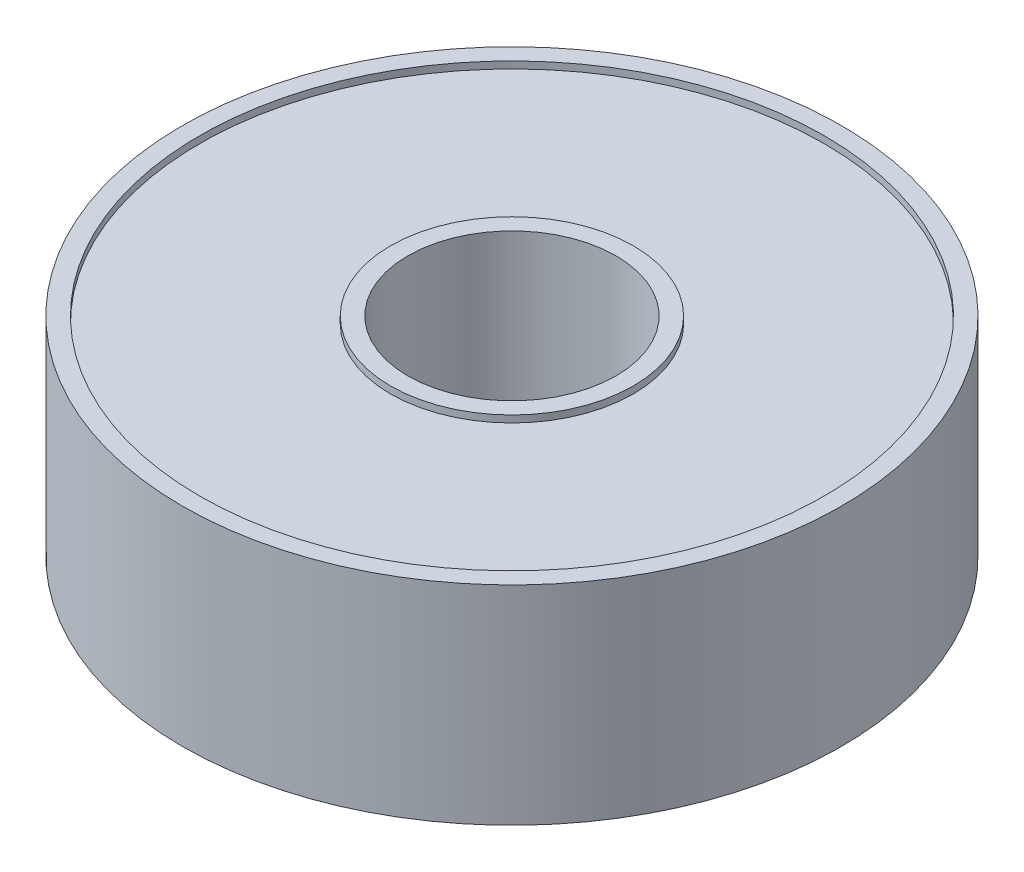
ISO-10303-21;
HEADER;
FILE_DESCRIPTION(('STEP AP214'),'2;1');
FILE_NAME('part.step','',(''),(''),'','','');
FILE_SCHEMA(('AUTOMOTIVE_DESIGN { 1 0 10303 214 1 1 1 1 }'));
ENDSEC;
DATA;
#1=APPLICATION_CONTEXT('core data for automotive mechanical design processes');
#2=APPLICATION_PROTOCOL_DEFINITION('international standard','automotive_design',2000,#1);
#3=PRODUCT_CONTEXT('',#1,'mechanical');
#4=PRODUCT('Part','Part','',(#3));
#5=PRODUCT_RELATED_PRODUCT_CATEGORY('part','',(#4));
#6=PRODUCT_DEFINITION_FORMATION('','',#4);
#7=PRODUCT_DEFINITION_CONTEXT('part definition',#1,'design');
#8=PRODUCT_DEFINITION('design','',#6,#7);
#9=PRODUCT_DEFINITION_SHAPE('','',#8);
#10=(LENGTH_UNIT() NAMED_UNIT(*) SI_UNIT(.MILLI.,.METRE.));
#11=(NAMED_UNIT(*) PLANE_ANGLE_UNIT() SI_UNIT($,.RADIAN.));
#12=(NAMED_UNIT(*) SI_UNIT($,.STERADIAN.) SOLID_ANGLE_UNIT());
#13=UNCERTAINTY_MEASURE_WITH_UNIT(LENGTH_MEASURE(1.E-05),#10,'distance_accuracy_value','');
#14=(GEOMETRIC_REPRESENTATION_CONTEXT(3) GLOBAL_UNCERTAINTY_ASSIGNED_CONTEXT((#13)) GLOBAL_UNIT_ASSIGNED_CONTEXT((#10,
#11,#12)) REPRESENTATION_CONTEXT('',''));
#15=CARTESIAN_POINT('',(0.,0.,0.));
#16=DIRECTION('',(0.,0.,1.));
#17=DIRECTION('',(1.,0.,0.));
#18=AXIS2_PLACEMENT_3D('',#15,#16,#17);
#19=CARTESIAN_POINT('',(0.,-3.,0.));
#20=DIRECTION('',(0.,1.,0.));
#21=DIRECTION('',(0.,0.,1.));
#22=AXIS2_PLACEMENT_3D('',#19,#20,#21);
#23=CYLINDRICAL_SURFACE('',#22,3.5);
#24=CARTESIAN_POINT('',(0.,-3.,0.));
#25=DIRECTION('',(0.,1.,0.));
#26=DIRECTION('',(0.,0.,1.));
#27=AXIS2_PLACEMENT_3D('',#24,#25,#26);
#28=CIRCLE('',#27,3.5);
#29=CARTESIAN_POINT('',(0.,-3.,3.5));
#30=VERTEX_POINT('',#29);
#31=EDGE_CURVE('E54',#30,#30,#28,.T.);
#32=ORIENTED_EDGE('',*,*,#31,.T.);
#33=EDGE_LOOP('',(#32));
#34=FACE_BOUND('',#33,.T.);
#35=CARTESIAN_POINT('',(0.,-2.8,0.));
#36=DIRECTION('',(0.,1.,0.));
#37=DIRECTION('',(0.,0.,1.));
#38=AXIS2_PLACEMENT_3D('',#35,#36,#37);
#39=CIRCLE('',#38,3.5);
#40=CARTESIAN_POINT('',(0.,-2.8,3.5));
#41=VERTEX_POINT('',#40);
#42=EDGE_CURVE('E73',#41,#41,#39,.T.);
#43=ORIENTED_EDGE('',*,*,#42,.F.);
#44=EDGE_LOOP('',(#43));
#45=FACE_BOUND('',#44,.T.);
#46=ADVANCED_FACE('F47',(#34,#45),#23,.T.);
#47=CARTESIAN_POINT('',(0.,-3.,0.));
#48=DIRECTION('',(0.,1.,0.));
#49=DIRECTION('',(0.,0.,1.));
#50=AXIS2_PLACEMENT_3D('',#47,#48,#49);
#51=CYLINDRICAL_SURFACE('',#50,3.);
#52=CARTESIAN_POINT('',(0.,-3.,0.));
#53=DIRECTION('',(0.,1.,0.));
#54=DIRECTION('',(0.,0.,1.));
#55=AXIS2_PLACEMENT_3D('',#52,#53,#54);
#56=CIRCLE('',#55,3.);
#57=CARTESIAN_POINT('',(0.,-3.,3.));
#58=VERTEX_POINT('',#57);
#59=EDGE_CURVE('E58',#58,#58,#56,.T.);
#60=ORIENTED_EDGE('',*,*,#59,.F.);
#61=EDGE_LOOP('',(#60));
#62=FACE_BOUND('',#61,.T.);
#63=CARTESIAN_POINT('',(0.,3.,0.));
#64=DIRECTION('',(0.,1.,0.));
#65=DIRECTION('',(0.,0.,1.));
#66=AXIS2_PLACEMENT_3D('',#63,#64,#65);
#67=CIRCLE('',#66,3.);
#68=CARTESIAN_POINT('',(0.,3.,3.));
#69=VERTEX_POINT('',#68);
#70=EDGE_CURVE('E67',#69,#69,#67,.T.);
#71=ORIENTED_EDGE('',*,*,#70,.T.);
#72=EDGE_LOOP('',(#71));
#73=FACE_BOUND('',#72,.T.);
#74=ADVANCED_FACE('F49',(#62,#73),#51,.F.);
#75=CARTESIAN_POINT('',(0.,2.8,0.));
#76=DIRECTION('',(0.,1.,0.));
#77=DIRECTION('',(0.,0.,1.));
#78=AXIS2_PLACEMENT_3D('',#75,#76,#77);
#79=CIRCLE('',#78,3.5);
#80=CARTESIAN_POINT('',(0.,2.8,3.5));
#81=VERTEX_POINT('',#80);
#82=EDGE_CURVE('E11',#81,#81,#79,.F.);
#83=ORIENTED_EDGE('',*,*,#82,.F.);
#84=EDGE_LOOP('',(#83));
#85=FACE_BOUND('',#84,.T.);
#86=CARTESIAN_POINT('',(0.,3.,0.));
#87=DIRECTION('',(0.,1.,0.));
#88=DIRECTION('',(0.,0.,1.));
#89=AXIS2_PLACEMENT_3D('',#86,#87,#88);
#90=CIRCLE('',#89,3.5);
#91=CARTESIAN_POINT('',(0.,3.,3.5));
#92=VERTEX_POINT('',#91);
#93=EDGE_CURVE('E62',#92,#92,#90,.T.);
#94=ORIENTED_EDGE('',*,*,#93,.F.);
#95=EDGE_LOOP('',(#94));
#96=FACE_BOUND('',#95,.T.);
#97=ADVANCED_FACE('F115',(#85,#96),#23,.T.);
#98=CARTESIAN_POINT('',(0.,-3.,0.));
#99=DIRECTION('',(0.,1.,0.));
#100=DIRECTION('',(0.,0.,1.));
#101=AXIS2_PLACEMENT_3D('',#98,#99,#100);
#102=PLANE('',#101);
#103=ORIENTED_EDGE('',*,*,#59,.T.);
#104=EDGE_LOOP('',(#103));
#105=FACE_BOUND('',#104,.T.);
#106=ORIENTED_EDGE('',*,*,#31,.F.);
#107=EDGE_LOOP('',(#106));
#108=FACE_BOUND('',#107,.T.);
#109=ADVANCED_FACE('F123',(#105,#108),#102,.F.);
#110=CARTESIAN_POINT('',(0.,3.,0.));
#111=DIRECTION('',(0.,1.,0.));
#112=DIRECTION('',(0.,0.,1.));
#113=AXIS2_PLACEMENT_3D('',#110,#111,#112);
#114=PLANE('',#113);
#115=ORIENTED_EDGE('',*,*,#70,.F.);
#116=EDGE_LOOP('',(#115));
#117=FACE_BOUND('',#116,.T.);
#118=ORIENTED_EDGE('',*,*,#93,.T.);
#119=EDGE_LOOP('',(#118));
#120=FACE_BOUND('',#119,.T.);
#121=ADVANCED_FACE('F128',(#117,#120),#114,.T.);
#122=CARTESIAN_POINT('',(0.,-2.8,0.));
#123=DIRECTION('',(0.,1.,0.));
#124=DIRECTION('',(0.,0.,1.));
#125=AXIS2_PLACEMENT_3D('',#122,#123,#124);
#126=PLANE('',#125);
#127=ORIENTED_EDGE('',*,*,#42,.T.);
#128=EDGE_LOOP('',(#127));
#129=FACE_BOUND('',#128,.T.);
#130=CARTESIAN_POINT('',(0.,-2.8,0.));
#131=DIRECTION('',(0.,1.,0.));
#132=DIRECTION('',(0.,0.,1.));
#133=AXIS2_PLACEMENT_3D('',#130,#131,#132);
#134=CIRCLE('',#133,9.);
#135=CARTESIAN_POINT('',(0.,-2.8,9.));
#136=VERTEX_POINT('',#135);
#137=EDGE_CURVE('E70',#136,#136,#134,.T.);
#138=ORIENTED_EDGE('',*,*,#137,.F.);
#139=EDGE_LOOP('',(#138));
#140=FACE_BOUND('',#139,.T.);
#141=ADVANCED_FACE('F134',(#129,#140),#126,.F.);
#142=CARTESIAN_POINT('',(0.,2.8,0.));
#143=DIRECTION('',(0.,1.,0.));
#144=DIRECTION('',(0.,0.,1.));
#145=AXIS2_PLACEMENT_3D('',#142,#143,#144);
#146=PLANE('',#145);
#147=ORIENTED_EDGE('',*,*,#82,.T.);
#148=EDGE_LOOP('',(#147));
#149=FACE_BOUND('',#148,.T.);
#150=CARTESIAN_POINT('',(0.,2.8,0.));
#151=DIRECTION('',(0.,1.,0.));
#152=DIRECTION('',(0.,0.,1.));
#153=AXIS2_PLACEMENT_3D('',#150,#151,#152);
#154=CIRCLE('',#153,9.);
#155=CARTESIAN_POINT('',(0.,2.8,9.));
#156=VERTEX_POINT('',#155);
#157=EDGE_CURVE('E76',#156,#156,#154,.T.);
#158=ORIENTED_EDGE('',*,*,#157,.T.);
#159=EDGE_LOOP('',(#158));
#160=FACE_BOUND('',#159,.T.);
#161=ADVANCED_FACE('F140',(#149,#160),#146,.T.);
#162=CARTESIAN_POINT('',(0.,-3.,0.));
#163=DIRECTION('',(0.,1.,0.));
#164=DIRECTION('',(0.,0.,1.));
#165=AXIS2_PLACEMENT_3D('',#162,#163,#164);
#166=CYLINDRICAL_SURFACE('',#165,9.);
#167=CARTESIAN_POINT('',(0.,-3.,0.));
#168=DIRECTION('',(0.,1.,0.));
#169=DIRECTION('',(0.,0.,1.));
#170=AXIS2_PLACEMENT_3D('',#167,#168,#169);
#171=CIRCLE('',#170,9.);
#172=CARTESIAN_POINT('',(0.,-3.,9.));
#173=VERTEX_POINT('',#172);
#174=EDGE_CURVE('E82',#173,#173,#171,.T.);
#175=ORIENTED_EDGE('',*,*,#174,.F.);
#176=EDGE_LOOP('',(#175));
#177=FACE_BOUND('',#176,.T.);
#178=ORIENTED_EDGE('',*,*,#137,.T.);
#179=EDGE_LOOP('',(#178));
#180=FACE_BOUND('',#179,.T.);
#181=ADVANCED_FACE('F111',(#177,#180),#166,.F.);
#182=ORIENTED_EDGE('',*,*,#157,.F.);
#183=EDGE_LOOP('',(#182));
#184=FACE_BOUND('',#183,.T.);
#185=CARTESIAN_POINT('',(0.,3.,0.));
#186=DIRECTION('',(0.,1.,0.));
#187=DIRECTION('',(0.,0.,1.));
#188=AXIS2_PLACEMENT_3D('',#185,#186,#187);
#189=CIRCLE('',#188,9.);
#190=CARTESIAN_POINT('',(0.,3.,9.));
#191=VERTEX_POINT('',#190);
#192=EDGE_CURVE('E88',#191,#191,#189,.T.);
#193=ORIENTED_EDGE('',*,*,#192,.T.);
#194=EDGE_LOOP('',(#193));
#195=FACE_BOUND('',#194,.T.);
#196=ADVANCED_FACE('F92',(#184,#195),#166,.F.);
#197=CARTESIAN_POINT('',(0.,-3.,0.));
#198=DIRECTION('',(0.,1.,0.));
#199=DIRECTION('',(0.,0.,1.));
#200=AXIS2_PLACEMENT_3D('',#197,#198,#199);
#201=CYLINDRICAL_SURFACE('',#200,9.5);
#202=CARTESIAN_POINT('',(0.,-3.,0.));
#203=DIRECTION('',(0.,1.,0.));
#204=DIRECTION('',(0.,0.,1.));
#205=AXIS2_PLACEMENT_3D('',#202,#203,#204);
#206=CIRCLE('',#205,9.5);
#207=CARTESIAN_POINT('',(0.,-3.,9.5));
#208=VERTEX_POINT('',#207);
#209=EDGE_CURVE('E79',#208,#208,#206,.T.);
#210=ORIENTED_EDGE('',*,*,#209,.T.);
#211=EDGE_LOOP('',(#210));
#212=FACE_BOUND('',#211,.T.);
#213=CARTESIAN_POINT('',(0.,3.,0.));
#214=DIRECTION('',(0.,1.,0.));
#215=DIRECTION('',(0.,0.,1.));
#216=AXIS2_PLACEMENT_3D('',#213,#214,#215);
#217=CIRCLE('',#216,9.5);
#218=CARTESIAN_POINT('',(0.,3.,9.5));
#219=VERTEX_POINT('',#218);
#220=EDGE_CURVE('E85',#219,#219,#217,.T.);
#221=ORIENTED_EDGE('',*,*,#220,.F.);
#222=EDGE_LOOP('',(#221));
#223=FACE_BOUND('',#222,.T.);
#224=ADVANCED_FACE('F101',(#212,#223),#201,.T.);
#225=CARTESIAN_POINT('',(0.,-3.,0.));
#226=DIRECTION('',(0.,1.,0.));
#227=DIRECTION('',(0.,0.,1.));
#228=AXIS2_PLACEMENT_3D('',#225,#226,#227);
#229=PLANE('',#228);
#230=ORIENTED_EDGE('',*,*,#174,.T.);
#231=EDGE_LOOP('',(#230));
#232=FACE_BOUND('',#231,.T.);
#233=ORIENTED_EDGE('',*,*,#209,.F.);
#234=EDGE_LOOP('',(#233));
#235=FACE_BOUND('',#234,.T.);
#236=ADVANCED_FACE('F97',(#232,#235),#229,.F.);
#237=CARTESIAN_POINT('',(0.,3.,0.));
#238=DIRECTION('',(0.,1.,0.));
#239=DIRECTION('',(0.,0.,1.));
#240=AXIS2_PLACEMENT_3D('',#237,#238,#239);
#241=PLANE('',#240);
#242=ORIENTED_EDGE('',*,*,#192,.F.);
#243=EDGE_LOOP('',(#242));
#244=FACE_BOUND('',#243,.T.);
#245=ORIENTED_EDGE('',*,*,#220,.T.);
#246=EDGE_LOOP('',(#245));
#247=FACE_BOUND('',#246,.T.);
#248=ADVANCED_FACE('F94',(#244,#247),#241,.T.);
#249=CLOSED_SHELL('',(#46,#74,#97,#109,#121,#141,#161,#181,#196,#224,#236,#248));
#250=MANIFOLD_SOLID_BREP('B2',#249);
#251=ADVANCED_BREP_SHAPE_REPRESENTATION('',(#18,#250),#14);
#252=SHAPE_DEFINITION_REPRESENTATION(#9,#251);
ENDSEC;
END-ISO-10303-21;
